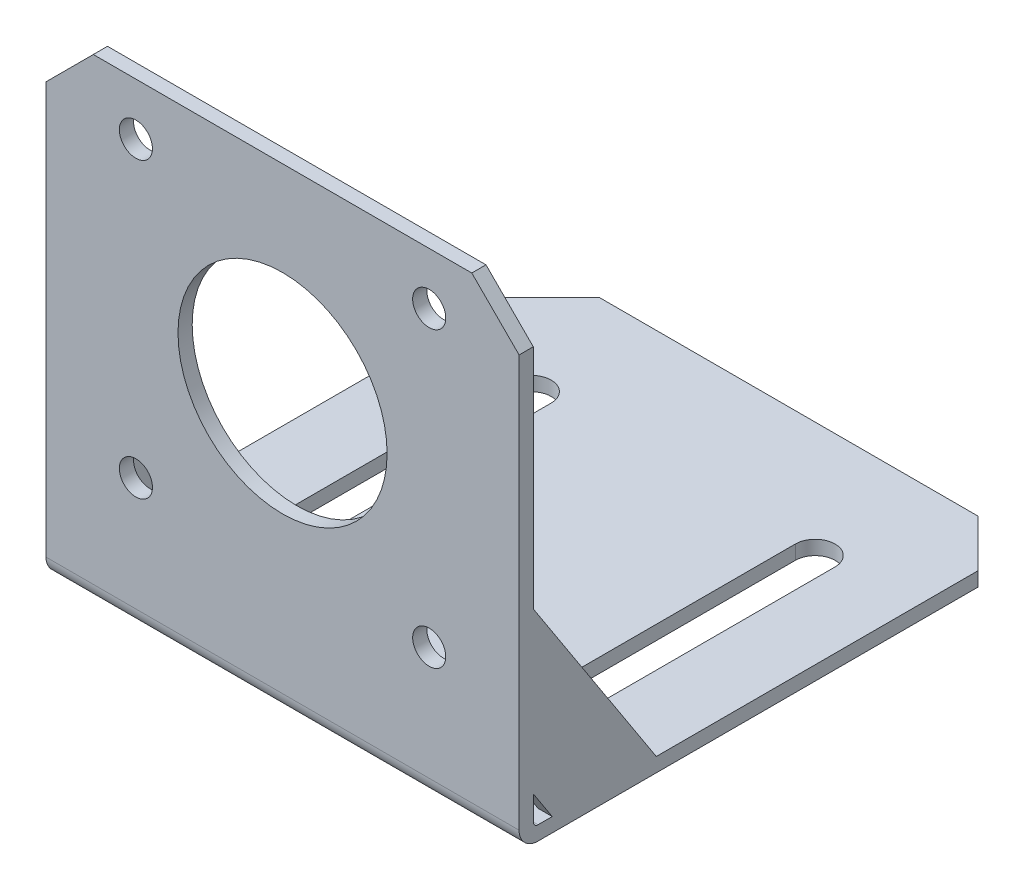
ISO-10303-21;
HEADER;
FILE_DESCRIPTION(('STEP AP214'),'2;1');
FILE_NAME('part.step','',(''),(''),'','','');
FILE_SCHEMA(('AUTOMOTIVE_DESIGN { 1 0 10303 214 1 1 1 1 }'));
ENDSEC;
DATA;
#1=APPLICATION_CONTEXT('core data for automotive mechanical design processes');
#2=APPLICATION_PROTOCOL_DEFINITION('international standard','automotive_design',2000,#1);
#3=PRODUCT_CONTEXT('',#1,'mechanical');
#4=PRODUCT('Part','Part','',(#3));
#5=PRODUCT_RELATED_PRODUCT_CATEGORY('part','',(#4));
#6=PRODUCT_DEFINITION_FORMATION('','',#4);
#7=PRODUCT_DEFINITION_CONTEXT('part definition',#1,'design');
#8=PRODUCT_DEFINITION('design','',#6,#7);
#9=PRODUCT_DEFINITION_SHAPE('','',#8);
#10=(LENGTH_UNIT() NAMED_UNIT(*) SI_UNIT(.MILLI.,.METRE.));
#11=(NAMED_UNIT(*) PLANE_ANGLE_UNIT() SI_UNIT($,.RADIAN.));
#12=(NAMED_UNIT(*) SI_UNIT($,.STERADIAN.) SOLID_ANGLE_UNIT());
#13=UNCERTAINTY_MEASURE_WITH_UNIT(LENGTH_MEASURE(1.E-05),#10,'distance_accuracy_value','');
#14=(GEOMETRIC_REPRESENTATION_CONTEXT(3) GLOBAL_UNCERTAINTY_ASSIGNED_CONTEXT((#13)) GLOBAL_UNIT_ASSIGNED_CONTEXT((#10,
#11,#12)) REPRESENTATION_CONTEXT('',''));
#15=CARTESIAN_POINT('',(0.,0.,0.));
#16=DIRECTION('',(0.,0.,1.));
#17=DIRECTION('',(1.,0.,0.));
#18=AXIS2_PLACEMENT_3D('',#15,#16,#17);
#19=CARTESIAN_POINT('',(50.,1.5,-2.00000000000001));
#20=DIRECTION('',(0.,1.,0.));
#21=DIRECTION('',(0.,0.,1.));
#22=AXIS2_PLACEMENT_3D('',#19,#20,#21);
#23=PLANE('',#22);
#24=CARTESIAN_POINT('',(40.,1.5,-13.7066664875901));
#25=DIRECTION('',(0.,1.,0.));
#26=DIRECTION('',(0.,0.,-1.));
#27=AXIS2_PLACEMENT_3D('',#24,#25,#26);
#28=CIRCLE('',#27,2.1);
#29=CARTESIAN_POINT('',(37.9,1.5,-13.7066664875901));
#30=VERTEX_POINT('',#29);
#31=CARTESIAN_POINT('',(42.1,1.5,-13.7066664875901));
#32=VERTEX_POINT('',#31);
#33=EDGE_CURVE('E225',#30,#32,#28,.T.);
#34=ORIENTED_EDGE('',*,*,#33,.F.);
#35=DIRECTION('',(0.,0.,1.));
#36=VECTOR('',#35,1.);
#37=CARTESIAN_POINT('',(37.9,1.5,-13.7066664875901));
#38=LINE('',#37,#36);
#39=CARTESIAN_POINT('',(37.9,1.5,-41.2933335124099));
#40=VERTEX_POINT('',#39);
#41=EDGE_CURVE('E243',#40,#30,#38,.T.);
#42=ORIENTED_EDGE('',*,*,#41,.F.);
#43=CARTESIAN_POINT('',(40.,1.5,-41.2933335124099));
#44=DIRECTION('',(0.,1.,0.));
#45=DIRECTION('',(0.,0.,-1.));
#46=AXIS2_PLACEMENT_3D('',#43,#44,#45);
#47=CIRCLE('',#46,2.09999999999998);
#48=CARTESIAN_POINT('',(42.1,1.5,-41.2933335124099));
#49=VERTEX_POINT('',#48);
#50=EDGE_CURVE('E246',#49,#40,#47,.T.);
#51=ORIENTED_EDGE('',*,*,#50,.F.);
#52=DIRECTION('',(0.,0.,-1.));
#53=VECTOR('',#52,1.);
#54=CARTESIAN_POINT('',(42.1,1.5,-13.7066664875901));
#55=LINE('',#54,#53);
#56=EDGE_CURVE('E252',#32,#49,#55,.T.);
#57=ORIENTED_EDGE('',*,*,#56,.F.);
#58=EDGE_LOOP('',(#34,#42,#51,#57));
#59=FACE_BOUND('',#58,.T.);
#60=CARTESIAN_POINT('',(10.,1.5,-13.7066664875901));
#61=DIRECTION('',(0.,1.,0.));
#62=DIRECTION('',(0.,0.,1.));
#63=AXIS2_PLACEMENT_3D('',#60,#61,#62);
#64=CIRCLE('',#63,2.10000000000001);
#65=CARTESIAN_POINT('',(7.9,1.5,-13.7066664875901));
#66=VERTEX_POINT('',#65);
#67=CARTESIAN_POINT('',(12.1,1.5,-13.7066664875901));
#68=VERTEX_POINT('',#67);
#69=EDGE_CURVE('E258',#66,#68,#64,.T.);
#70=ORIENTED_EDGE('',*,*,#69,.F.);
#71=DIRECTION('',(0.,0.,1.));
#72=VECTOR('',#71,1.);
#73=CARTESIAN_POINT('',(7.9,1.5,-13.7066664875901));
#74=LINE('',#73,#72);
#75=CARTESIAN_POINT('',(7.90000000000001,1.5,-41.2933335124099));
#76=VERTEX_POINT('',#75);
#77=EDGE_CURVE('E266',#76,#66,#74,.T.);
#78=ORIENTED_EDGE('',*,*,#77,.F.);
#79=CARTESIAN_POINT('',(10.,1.5,-41.2933335124099));
#80=DIRECTION('',(0.,1.,0.));
#81=DIRECTION('',(0.,0.,1.));
#82=AXIS2_PLACEMENT_3D('',#79,#80,#81);
#83=CIRCLE('',#82,2.09999999999999);
#84=CARTESIAN_POINT('',(12.1,1.5,-41.2933335124099));
#85=VERTEX_POINT('',#84);
#86=EDGE_CURVE('E280',#85,#76,#83,.T.);
#87=ORIENTED_EDGE('',*,*,#86,.F.);
#88=DIRECTION('',(0.,0.,-1.));
#89=VECTOR('',#88,1.);
#90=CARTESIAN_POINT('',(12.1,1.5,-13.7066664875901));
#91=LINE('',#90,#89);
#92=EDGE_CURVE('E277',#68,#85,#91,.T.);
#93=ORIENTED_EDGE('',*,*,#92,.F.);
#94=EDGE_LOOP('',(#70,#78,#87,#93));
#95=FACE_BOUND('',#94,.T.);
#96=DIRECTION('',(-1.,0.,0.));
#97=VECTOR('',#96,1.);
#98=CARTESIAN_POINT('',(50.,1.5,-53.5));
#99=LINE('',#98,#97);
#100=CARTESIAN_POINT('',(45.,1.5,-53.5));
#101=VERTEX_POINT('',#100);
#102=CARTESIAN_POINT('',(5.00000000000003,1.5,-53.5));
#103=VERTEX_POINT('',#102);
#104=EDGE_CURVE('E426',#101,#103,#99,.T.);
#105=ORIENTED_EDGE('',*,*,#104,.T.);
#106=DIRECTION('',(-0.707106781186549,0.,0.707106781186547));
#107=VECTOR('',#106,1.);
#108=CARTESIAN_POINT('',(1.75000000000008,1.5,-50.2500000000001));
#109=LINE('',#108,#107);
#110=CARTESIAN_POINT('',(0.,1.5,-48.5));
#111=VERTEX_POINT('',#110);
#112=EDGE_CURVE('E11',#103,#111,#109,.T.);
#113=ORIENTED_EDGE('',*,*,#112,.T.);
#114=DIRECTION('',(0.,0.,-1.));
#115=VECTOR('',#114,1.);
#116=CARTESIAN_POINT('',(0.,1.5,-2.00000000000001));
#117=LINE('',#116,#115);
#118=CARTESIAN_POINT('',(0.,1.5,-14.5));
#119=VERTEX_POINT('',#118);
#120=EDGE_CURVE('E397',#119,#111,#117,.T.);
#121=ORIENTED_EDGE('',*,*,#120,.F.);
#122=DIRECTION('',(-1.,0.,0.));
#123=VECTOR('',#122,1.);
#124=CARTESIAN_POINT('',(1.5,1.5,-14.5));
#125=LINE('',#124,#123);
#126=CARTESIAN_POINT('',(1.5,1.5,-14.5));
#127=VERTEX_POINT('',#126);
#128=EDGE_CURVE('E314',#127,#119,#125,.T.);
#129=ORIENTED_EDGE('',*,*,#128,.F.);
#130=DIRECTION('',(0.,0.,-1.));
#131=VECTOR('',#130,1.);
#132=CARTESIAN_POINT('',(1.5,1.5,-3.5));
#133=LINE('',#132,#131);
#134=CARTESIAN_POINT('',(1.5,1.5,-3.5));
#135=VERTEX_POINT('',#134);
#136=EDGE_CURVE('E300',#135,#127,#133,.T.);
#137=ORIENTED_EDGE('',*,*,#136,.F.);
#138=DIRECTION('',(-1.,0.,0.));
#139=VECTOR('',#138,1.);
#140=CARTESIAN_POINT('',(1.5,1.5,-3.5));
#141=LINE('',#140,#139);
#142=CARTESIAN_POINT('',(0.,1.5,-3.5));
#143=VERTEX_POINT('',#142);
#144=EDGE_CURVE('E311',#135,#143,#141,.T.);
#145=ORIENTED_EDGE('',*,*,#144,.T.);
#146=CARTESIAN_POINT('',(0.,1.5,-2.00000000000001));
#147=VERTEX_POINT('',#146);
#148=EDGE_CURVE('E398',#147,#143,#117,.T.);
#149=ORIENTED_EDGE('',*,*,#148,.F.);
#150=DIRECTION('',(-1.,0.,0.));
#151=VECTOR('',#150,1.);
#152=CARTESIAN_POINT('',(50.,1.5,-2.00000000000001));
#153=LINE('',#152,#151);
#154=CARTESIAN_POINT('',(50.,1.5,-2.00000000000001));
#155=VERTEX_POINT('',#154);
#156=EDGE_CURVE('E424',#155,#147,#153,.T.);
#157=ORIENTED_EDGE('',*,*,#156,.F.);
#158=DIRECTION('',(0.,0.,-1.));
#159=VECTOR('',#158,1.);
#160=CARTESIAN_POINT('',(50.,1.5,-2.00000000000001));
#161=LINE('',#160,#159);
#162=CARTESIAN_POINT('',(50.,1.5,-3.5));
#163=VERTEX_POINT('',#162);
#164=EDGE_CURVE('E382',#155,#163,#161,.T.);
#165=ORIENTED_EDGE('',*,*,#164,.T.);
#166=DIRECTION('',(1.,0.,0.));
#167=VECTOR('',#166,1.);
#168=CARTESIAN_POINT('',(48.5,1.5,-3.5));
#169=LINE('',#168,#167);
#170=CARTESIAN_POINT('',(48.5,1.5,-3.5));
#171=VERTEX_POINT('',#170);
#172=EDGE_CURVE('E342',#171,#163,#169,.T.);
#173=ORIENTED_EDGE('',*,*,#172,.F.);
#174=DIRECTION('',(0.,0.,-1.));
#175=VECTOR('',#174,1.);
#176=CARTESIAN_POINT('',(48.5,1.5,-3.5));
#177=LINE('',#176,#175);
#178=CARTESIAN_POINT('',(48.5,1.5,-14.5));
#179=VERTEX_POINT('',#178);
#180=EDGE_CURVE('E325',#171,#179,#177,.T.);
#181=ORIENTED_EDGE('',*,*,#180,.T.);
#182=DIRECTION('',(1.,0.,0.));
#183=VECTOR('',#182,1.);
#184=CARTESIAN_POINT('',(48.5,1.5,-14.5));
#185=LINE('',#184,#183);
#186=CARTESIAN_POINT('',(50.,1.5,-14.5));
#187=VERTEX_POINT('',#186);
#188=EDGE_CURVE('E339',#179,#187,#185,.T.);
#189=ORIENTED_EDGE('',*,*,#188,.T.);
#190=CARTESIAN_POINT('',(50.,1.5,-48.5));
#191=VERTEX_POINT('',#190);
#192=EDGE_CURVE('E380',#187,#191,#161,.T.);
#193=ORIENTED_EDGE('',*,*,#192,.T.);
#194=DIRECTION('',(0.707106781186547,0.,0.707106781186549));
#195=VECTOR('',#194,1.);
#196=CARTESIAN_POINT('',(73.25,1.5,-25.2499999999999));
#197=LINE('',#196,#195);
#198=EDGE_CURVE('E41',#191,#101,#197,.F.);
#199=ORIENTED_EDGE('',*,*,#198,.T.);
#200=EDGE_LOOP('',(#105,#113,#121,#129,#137,#145,#149,#157,#165,#173,#181,#189,#193,#199));
#201=FACE_BOUND('',#200,.T.);
#202=ADVANCED_FACE('F33',(#59,#95,#201),#23,.T.);
#203=CARTESIAN_POINT('',(50.,2.00000000000001,-1.5));
#204=DIRECTION('',(0.,0.,-1.));
#205=DIRECTION('',(-1.,0.,0.));
#206=AXIS2_PLACEMENT_3D('',#203,#204,#205);
#207=PLANE('',#206);
#208=CARTESIAN_POINT('',(25.,29.5,-1.5));
#209=DIRECTION('',(0.,0.,-1.));
#210=DIRECTION('',(-1.,0.,0.));
#211=AXIS2_PLACEMENT_3D('',#208,#209,#210);
#212=CIRCLE('',#211,11.05);
#213=CARTESIAN_POINT('',(13.95,29.5,-1.5));
#214=VERTEX_POINT('',#213);
#215=EDGE_CURVE('E368',#214,#214,#212,.T.);
#216=ORIENTED_EDGE('',*,*,#215,.F.);
#217=EDGE_LOOP('',(#216));
#218=FACE_BOUND('',#217,.T.);
#219=CARTESIAN_POINT('',(40.5,45.,-1.5));
#220=DIRECTION('',(0.,0.,-1.));
#221=DIRECTION('',(-1.,0.,0.));
#222=AXIS2_PLACEMENT_3D('',#219,#220,#221);
#223=CIRCLE('',#222,1.75);
#224=CARTESIAN_POINT('',(38.75,45.,-1.5));
#225=VERTEX_POINT('',#224);
#226=EDGE_CURVE('E362',#225,#225,#223,.T.);
#227=ORIENTED_EDGE('',*,*,#226,.F.);
#228=EDGE_LOOP('',(#227));
#229=FACE_BOUND('',#228,.T.);
#230=CARTESIAN_POINT('',(9.49999999999999,45.,-1.5));
#231=DIRECTION('',(0.,0.,-1.));
#232=DIRECTION('',(-1.,0.,0.));
#233=AXIS2_PLACEMENT_3D('',#230,#231,#232);
#234=CIRCLE('',#233,1.75);
#235=CARTESIAN_POINT('',(7.74999999999999,45.,-1.5));
#236=VERTEX_POINT('',#235);
#237=EDGE_CURVE('E356',#236,#236,#234,.T.);
#238=ORIENTED_EDGE('',*,*,#237,.F.);
#239=EDGE_LOOP('',(#238));
#240=FACE_BOUND('',#239,.T.);
#241=CARTESIAN_POINT('',(9.5,14.,-1.5));
#242=DIRECTION('',(0.,0.,-1.));
#243=DIRECTION('',(-1.,0.,0.));
#244=AXIS2_PLACEMENT_3D('',#241,#242,#243);
#245=CIRCLE('',#244,1.75000000000001);
#246=CARTESIAN_POINT('',(7.74999999999999,14.,-1.5));
#247=VERTEX_POINT('',#246);
#248=EDGE_CURVE('E350',#247,#247,#245,.T.);
#249=ORIENTED_EDGE('',*,*,#248,.F.);
#250=EDGE_LOOP('',(#249));
#251=FACE_BOUND('',#250,.T.);
#252=CARTESIAN_POINT('',(40.5,14.,-1.5));
#253=DIRECTION('',(0.,0.,-1.));
#254=DIRECTION('',(-1.,0.,0.));
#255=AXIS2_PLACEMENT_3D('',#252,#253,#254);
#256=CIRCLE('',#255,1.75000000000001);
#257=CARTESIAN_POINT('',(38.75,14.,-1.5));
#258=VERTEX_POINT('',#257);
#259=EDGE_CURVE('E338',#258,#258,#256,.T.);
#260=ORIENTED_EDGE('',*,*,#259,.F.);
#261=EDGE_LOOP('',(#260));
#262=FACE_BOUND('',#261,.T.);
#263=DIRECTION('',(-1.,0.,0.));
#264=VECTOR('',#263,1.);
#265=CARTESIAN_POINT('',(50.,50.5,-1.5));
#266=LINE('',#265,#264);
#267=CARTESIAN_POINT('',(45.,50.5,-1.5));
#268=VERTEX_POINT('',#267);
#269=CARTESIAN_POINT('',(5.00000000000003,50.5,-1.5));
#270=VERTEX_POINT('',#269);
#271=EDGE_CURVE('E418',#268,#270,#266,.T.);
#272=ORIENTED_EDGE('',*,*,#271,.F.);
#273=DIRECTION('',(-0.707106781186547,0.707106781186549,0.));
#274=VECTOR('',#273,1.);
#275=CARTESIAN_POINT('',(71.75,23.7499999999999,-1.5));
#276=LINE('',#275,#274);
#277=CARTESIAN_POINT('',(50.,45.5,-1.5));
#278=VERTEX_POINT('',#277);
#279=EDGE_CURVE('E437',#268,#278,#276,.F.);
#280=ORIENTED_EDGE('',*,*,#279,.T.);
#281=DIRECTION('',(0.,1.,0.));
#282=VECTOR('',#281,1.);
#283=CARTESIAN_POINT('',(50.,2.00000000000001,-1.5));
#284=LINE('',#283,#282);
#285=CARTESIAN_POINT('',(50.,21.5,-1.5));
#286=VERTEX_POINT('',#285);
#287=EDGE_CURVE('E388',#278,#286,#284,.F.);
#288=ORIENTED_EDGE('',*,*,#287,.T.);
#289=DIRECTION('',(1.,0.,0.));
#290=VECTOR('',#289,1.);
#291=CARTESIAN_POINT('',(48.5,21.5,-1.5));
#292=LINE('',#291,#290);
#293=CARTESIAN_POINT('',(48.5,21.5,-1.5));
#294=VERTEX_POINT('',#293);
#295=EDGE_CURVE('E335',#294,#286,#292,.T.);
#296=ORIENTED_EDGE('',*,*,#295,.F.);
#297=DIRECTION('',(0.,-1.,0.));
#298=VECTOR('',#297,1.);
#299=CARTESIAN_POINT('',(48.5,21.5,-1.5));
#300=LINE('',#299,#298);
#301=CARTESIAN_POINT('',(48.5,4.57692307692308,-1.5));
#302=VERTEX_POINT('',#301);
#303=EDGE_CURVE('E319',#294,#302,#300,.T.);
#304=ORIENTED_EDGE('',*,*,#303,.T.);
#305=DIRECTION('',(1.,0.,0.));
#306=VECTOR('',#305,1.);
#307=CARTESIAN_POINT('',(48.5,4.57692307692308,-1.5));
#308=LINE('',#307,#306);
#309=CARTESIAN_POINT('',(50.,4.57692307692308,-1.5));
#310=VERTEX_POINT('',#309);
#311=EDGE_CURVE('E330',#302,#310,#308,.T.);
#312=ORIENTED_EDGE('',*,*,#311,.T.);
#313=CARTESIAN_POINT('',(50.,2.,-1.5));
#314=VERTEX_POINT('',#313);
#315=EDGE_CURVE('E387',#310,#314,#284,.F.);
#316=ORIENTED_EDGE('',*,*,#315,.T.);
#317=DIRECTION('',(-1.,0.,0.));
#318=VECTOR('',#317,1.);
#319=CARTESIAN_POINT('',(50.,2.,-1.5));
#320=LINE('',#319,#318);
#321=CARTESIAN_POINT('',(0.,2.,-1.5));
#322=VERTEX_POINT('',#321);
#323=EDGE_CURVE('E421',#314,#322,#320,.T.);
#324=ORIENTED_EDGE('',*,*,#323,.T.);
#325=DIRECTION('',(0.,1.,0.));
#326=VECTOR('',#325,1.);
#327=CARTESIAN_POINT('',(0.,2.00000000000001,-1.5));
#328=LINE('',#327,#326);
#329=CARTESIAN_POINT('',(0.,4.57692307692308,-1.5));
#330=VERTEX_POINT('',#329);
#331=EDGE_CURVE('E404',#330,#322,#328,.F.);
#332=ORIENTED_EDGE('',*,*,#331,.F.);
#333=DIRECTION('',(-1.,0.,0.));
#334=VECTOR('',#333,1.);
#335=CARTESIAN_POINT('',(1.5,4.57692307692308,-1.5));
#336=LINE('',#335,#334);
#337=CARTESIAN_POINT('',(1.5,4.57692307692308,-1.5));
#338=VERTEX_POINT('',#337);
#339=EDGE_CURVE('E308',#338,#330,#336,.T.);
#340=ORIENTED_EDGE('',*,*,#339,.F.);
#341=DIRECTION('',(0.,-1.,0.));
#342=VECTOR('',#341,1.);
#343=CARTESIAN_POINT('',(1.5,21.5,-1.5));
#344=LINE('',#343,#342);
#345=CARTESIAN_POINT('',(1.5,21.5,-1.5));
#346=VERTEX_POINT('',#345);
#347=EDGE_CURVE('E294',#346,#338,#344,.T.);
#348=ORIENTED_EDGE('',*,*,#347,.F.);
#349=DIRECTION('',(-1.,0.,0.));
#350=VECTOR('',#349,1.);
#351=CARTESIAN_POINT('',(1.5,21.5,-1.5));
#352=LINE('',#351,#350);
#353=CARTESIAN_POINT('',(0.,21.5,-1.5));
#354=VERTEX_POINT('',#353);
#355=EDGE_CURVE('E304',#346,#354,#352,.T.);
#356=ORIENTED_EDGE('',*,*,#355,.T.);
#357=CARTESIAN_POINT('',(0.,45.5,-1.5));
#358=VERTEX_POINT('',#357);
#359=EDGE_CURVE('E405',#358,#354,#328,.F.);
#360=ORIENTED_EDGE('',*,*,#359,.F.);
#361=DIRECTION('',(0.707106781186549,0.707106781186547,0.));
#362=VECTOR('',#361,1.);
#363=CARTESIAN_POINT('',(3.25000000000009,48.7500000000001,-1.5));
#364=LINE('',#363,#362);
#365=EDGE_CURVE('E435',#358,#270,#364,.T.);
#366=ORIENTED_EDGE('',*,*,#365,.T.);
#367=EDGE_LOOP('',(#272,#280,#288,#296,#304,#312,#316,#324,#332,#340,#348,#356,#360,#366));
#368=FACE_BOUND('',#367,.T.);
#369=ADVANCED_FACE('F533',(#218,#229,#240,#251,#262,#368),#207,.T.);
#370=CARTESIAN_POINT('',(50.,0.,-2.00000000000001));
#371=DIRECTION('',(0.,1.,0.));
#372=DIRECTION('',(0.,0.,1.));
#373=AXIS2_PLACEMENT_3D('',#370,#371,#372);
#374=PLANE('',#373);
#375=DIRECTION('',(0.,0.,1.));
#376=VECTOR('',#375,1.);
#377=CARTESIAN_POINT('',(37.9,0.,-13.7066664875901));
#378=LINE('',#377,#376);
#379=CARTESIAN_POINT('',(37.9,0.,-41.2933335124099));
#380=VERTEX_POINT('',#379);
#381=CARTESIAN_POINT('',(37.9,0.,-13.7066664875901));
#382=VERTEX_POINT('',#381);
#383=EDGE_CURVE('E230',#380,#382,#378,.T.);
#384=ORIENTED_EDGE('',*,*,#383,.T.);
#385=CARTESIAN_POINT('',(40.,0.,-13.7066664875901));
#386=DIRECTION('',(0.,1.,0.));
#387=DIRECTION('',(0.,0.,-1.));
#388=AXIS2_PLACEMENT_3D('',#385,#386,#387);
#389=CIRCLE('',#388,2.1);
#390=CARTESIAN_POINT('',(42.1,0.,-13.7066664875901));
#391=VERTEX_POINT('',#390);
#392=EDGE_CURVE('E222',#382,#391,#389,.T.);
#393=ORIENTED_EDGE('',*,*,#392,.T.);
#394=DIRECTION('',(0.,0.,-1.));
#395=VECTOR('',#394,1.);
#396=CARTESIAN_POINT('',(42.1,0.,-13.7066664875901));
#397=LINE('',#396,#395);
#398=CARTESIAN_POINT('',(42.1,0.,-41.2933335124099));
#399=VERTEX_POINT('',#398);
#400=EDGE_CURVE('E234',#391,#399,#397,.T.);
#401=ORIENTED_EDGE('',*,*,#400,.T.);
#402=CARTESIAN_POINT('',(40.,0.,-41.2933335124099));
#403=DIRECTION('',(0.,1.,0.));
#404=DIRECTION('',(0.,0.,-1.));
#405=AXIS2_PLACEMENT_3D('',#402,#403,#404);
#406=CIRCLE('',#405,2.09999999999998);
#407=EDGE_CURVE('E238',#399,#380,#406,.T.);
#408=ORIENTED_EDGE('',*,*,#407,.T.);
#409=EDGE_LOOP('',(#384,#393,#401,#408));
#410=FACE_BOUND('',#409,.T.);
#411=DIRECTION('',(0.,0.,1.));
#412=VECTOR('',#411,1.);
#413=CARTESIAN_POINT('',(7.9,0.,-13.7066664875901));
#414=LINE('',#413,#412);
#415=CARTESIAN_POINT('',(7.90000000000001,0.,-41.2933335124099));
#416=VERTEX_POINT('',#415);
#417=CARTESIAN_POINT('',(7.9,0.,-13.7066664875901));
#418=VERTEX_POINT('',#417);
#419=EDGE_CURVE('E272',#416,#418,#414,.T.);
#420=ORIENTED_EDGE('',*,*,#419,.T.);
#421=CARTESIAN_POINT('',(10.,0.,-13.7066664875901));
#422=DIRECTION('',(0.,1.,0.));
#423=DIRECTION('',(0.,0.,1.));
#424=AXIS2_PLACEMENT_3D('',#421,#422,#423);
#425=CIRCLE('',#424,2.10000000000001);
#426=CARTESIAN_POINT('',(12.1,0.,-13.7066664875901));
#427=VERTEX_POINT('',#426);
#428=EDGE_CURVE('E262',#418,#427,#425,.T.);
#429=ORIENTED_EDGE('',*,*,#428,.T.);
#430=DIRECTION('',(0.,0.,-1.));
#431=VECTOR('',#430,1.);
#432=CARTESIAN_POINT('',(12.1,0.,-13.7066664875901));
#433=LINE('',#432,#431);
#434=CARTESIAN_POINT('',(12.1,0.,-41.2933335124099));
#435=VERTEX_POINT('',#434);
#436=EDGE_CURVE('E265',#427,#435,#433,.T.);
#437=ORIENTED_EDGE('',*,*,#436,.T.);
#438=CARTESIAN_POINT('',(10.,0.,-41.2933335124099));
#439=DIRECTION('',(0.,1.,0.));
#440=DIRECTION('',(0.,0.,1.));
#441=AXIS2_PLACEMENT_3D('',#438,#439,#440);
#442=CIRCLE('',#441,2.09999999999999);
#443=EDGE_CURVE('E269',#435,#416,#442,.T.);
#444=ORIENTED_EDGE('',*,*,#443,.T.);
#445=EDGE_LOOP('',(#420,#429,#437,#444));
#446=FACE_BOUND('',#445,.T.);
#447=DIRECTION('',(0.,0.,-1.));
#448=VECTOR('',#447,1.);
#449=CARTESIAN_POINT('',(0.,0.,-2.00000000000001));
#450=LINE('',#449,#448);
#451=CARTESIAN_POINT('',(0.,0.,-2.00000000000001));
#452=VERTEX_POINT('',#451);
#453=CARTESIAN_POINT('',(0.,0.,-48.5));
#454=VERTEX_POINT('',#453);
#455=EDGE_CURVE('E374',#452,#454,#450,.T.);
#456=ORIENTED_EDGE('',*,*,#455,.T.);
#457=DIRECTION('',(0.707106781186549,0.,-0.707106781186547));
#458=VECTOR('',#457,1.);
#459=CARTESIAN_POINT('',(0.,0.,-48.5));
#460=LINE('',#459,#458);
#461=CARTESIAN_POINT('',(5.00000000000002,0.,-53.5));
#462=VERTEX_POINT('',#461);
#463=EDGE_CURVE('E455',#454,#462,#460,.T.);
#464=ORIENTED_EDGE('',*,*,#463,.T.);
#465=DIRECTION('',(-1.,0.,0.));
#466=VECTOR('',#465,1.);
#467=CARTESIAN_POINT('',(50.,0.,-53.5));
#468=LINE('',#467,#466);
#469=CARTESIAN_POINT('',(45.,0.,-53.5));
#470=VERTEX_POINT('',#469);
#471=EDGE_CURVE('E428',#470,#462,#468,.T.);
#472=ORIENTED_EDGE('',*,*,#471,.F.);
#473=DIRECTION('',(-0.707106781186547,0.,-0.707106781186549));
#474=VECTOR('',#473,1.);
#475=CARTESIAN_POINT('',(45.,0.,-53.5));
#476=LINE('',#475,#474);
#477=CARTESIAN_POINT('',(50.,0.,-48.5));
#478=VERTEX_POINT('',#477);
#479=EDGE_CURVE('E453',#470,#478,#476,.F.);
#480=ORIENTED_EDGE('',*,*,#479,.T.);
#481=DIRECTION('',(0.,0.,-1.));
#482=VECTOR('',#481,1.);
#483=CARTESIAN_POINT('',(50.,0.,-2.00000000000001));
#484=LINE('',#483,#482);
#485=CARTESIAN_POINT('',(50.,0.,-2.00000000000001));
#486=VERTEX_POINT('',#485);
#487=EDGE_CURVE('E377',#486,#478,#484,.T.);
#488=ORIENTED_EDGE('',*,*,#487,.F.);
#489=DIRECTION('',(-1.,0.,0.));
#490=VECTOR('',#489,1.);
#491=CARTESIAN_POINT('',(50.,0.,-2.00000000000001));
#492=LINE('',#491,#490);
#493=EDGE_CURVE('E394',#486,#452,#492,.T.);
#494=ORIENTED_EDGE('',*,*,#493,.T.);
#495=EDGE_LOOP('',(#456,#464,#472,#480,#488,#494));
#496=FACE_BOUND('',#495,.T.);
#497=ADVANCED_FACE('F240',(#410,#446,#496),#374,.F.);
#498=CARTESIAN_POINT('',(50.,1.5,-53.5));
#499=DIRECTION('',(0.,0.,-1.));
#500=DIRECTION('',(-1.,0.,0.));
#501=AXIS2_PLACEMENT_3D('',#498,#499,#500);
#502=PLANE('',#501);
#503=ORIENTED_EDGE('',*,*,#471,.T.);
#504=DIRECTION('',(0.,1.,0.));
#505=VECTOR('',#504,1.);
#506=CARTESIAN_POINT('',(5.00000000000002,1.5,-53.5));
#507=LINE('',#506,#505);
#508=EDGE_CURVE('E48',#462,#103,#507,.T.);
#509=ORIENTED_EDGE('',*,*,#508,.T.);
#510=ORIENTED_EDGE('',*,*,#104,.F.);
#511=DIRECTION('',(0.,-1.,0.));
#512=VECTOR('',#511,1.);
#513=CARTESIAN_POINT('',(45.,1.5,-53.5));
#514=LINE('',#513,#512);
#515=EDGE_CURVE('E457',#101,#470,#514,.T.);
#516=ORIENTED_EDGE('',*,*,#515,.T.);
#517=EDGE_LOOP('',(#503,#509,#510,#516));
#518=FACE_BOUND('',#517,.T.);
#519=ADVANCED_FACE('F462',(#518),#502,.T.);
#520=CARTESIAN_POINT('',(50.,2.,-2.));
#521=DIRECTION('',(-1.,0.,0.));
#522=DIRECTION('',(0.,0.,1.));
#523=AXIS2_PLACEMENT_3D('',#520,#521,#522);
#524=CYLINDRICAL_SURFACE('',#523,0.5);
#525=CARTESIAN_POINT('',(0.,2.,-2.));
#526=DIRECTION('',(1.,0.,0.));
#527=DIRECTION('',(0.,0.,-1.));
#528=AXIS2_PLACEMENT_3D('',#525,#526,#527);
#529=CIRCLE('',#528,0.5);
#530=EDGE_CURVE('E401',#322,#147,#529,.T.);
#531=ORIENTED_EDGE('',*,*,#530,.F.);
#532=ORIENTED_EDGE('',*,*,#323,.F.);
#533=CARTESIAN_POINT('',(50.,2.,-2.));
#534=DIRECTION('',(1.,0.,0.));
#535=DIRECTION('',(0.,0.,-1.));
#536=AXIS2_PLACEMENT_3D('',#533,#534,#535);
#537=CIRCLE('',#536,0.5);
#538=EDGE_CURVE('E384',#314,#155,#537,.T.);
#539=ORIENTED_EDGE('',*,*,#538,.T.);
#540=ORIENTED_EDGE('',*,*,#156,.T.);
#541=EDGE_LOOP('',(#531,#532,#539,#540));
#542=FACE_BOUND('',#541,.T.);
#543=ADVANCED_FACE('F497',(#542),#524,.F.);
#544=CARTESIAN_POINT('',(50.,50.5,0.));
#545=DIRECTION('',(0.,1.,0.));
#546=DIRECTION('',(0.,0.,1.));
#547=AXIS2_PLACEMENT_3D('',#544,#545,#546);
#548=PLANE('',#547);
#549=DIRECTION('',(-1.,0.,0.));
#550=VECTOR('',#549,1.);
#551=CARTESIAN_POINT('',(50.,50.5,0.));
#552=LINE('',#551,#550);
#553=CARTESIAN_POINT('',(45.,50.5,0.));
#554=VERTEX_POINT('',#553);
#555=CARTESIAN_POINT('',(5.00000000000005,50.5,0.));
#556=VERTEX_POINT('',#555);
#557=EDGE_CURVE('E415',#554,#556,#552,.T.);
#558=ORIENTED_EDGE('',*,*,#557,.F.);
#559=DIRECTION('',(0.,0.,-1.));
#560=VECTOR('',#559,1.);
#561=CARTESIAN_POINT('',(45.,50.5,0.));
#562=LINE('',#561,#560);
#563=EDGE_CURVE('E432',#554,#268,#562,.T.);
#564=ORIENTED_EDGE('',*,*,#563,.T.);
#565=ORIENTED_EDGE('',*,*,#271,.T.);
#566=DIRECTION('',(0.,0.,1.));
#567=VECTOR('',#566,1.);
#568=CARTESIAN_POINT('',(5.00000000000003,50.5,0.));
#569=LINE('',#568,#567);
#570=EDGE_CURVE('E430',#270,#556,#569,.T.);
#571=ORIENTED_EDGE('',*,*,#570,.T.);
#572=EDGE_LOOP('',(#558,#564,#565,#571));
#573=FACE_BOUND('',#572,.T.);
#574=ADVANCED_FACE('F536',(#573),#548,.T.);
#575=CARTESIAN_POINT('',(50.,2.00000000000001,0.));
#576=DIRECTION('',(0.,0.,-1.));
#577=DIRECTION('',(-1.,0.,0.));
#578=AXIS2_PLACEMENT_3D('',#575,#576,#577);
#579=PLANE('',#578);
#580=CARTESIAN_POINT('',(40.5,14.,0.));
#581=DIRECTION('',(0.,0.,-1.));
#582=DIRECTION('',(-1.,0.,0.));
#583=AXIS2_PLACEMENT_3D('',#580,#581,#582);
#584=CIRCLE('',#583,1.75000000000001);
#585=CARTESIAN_POINT('',(38.75,14.,0.));
#586=VERTEX_POINT('',#585);
#587=EDGE_CURVE('E347',#586,#586,#584,.T.);
#588=ORIENTED_EDGE('',*,*,#587,.T.);
#589=EDGE_LOOP('',(#588));
#590=FACE_BOUND('',#589,.T.);
#591=CARTESIAN_POINT('',(9.5,14.,0.));
#592=DIRECTION('',(0.,0.,-1.));
#593=DIRECTION('',(-1.,0.,0.));
#594=AXIS2_PLACEMENT_3D('',#591,#592,#593);
#595=CIRCLE('',#594,1.75000000000001);
#596=CARTESIAN_POINT('',(7.74999999999999,14.,0.));
#597=VERTEX_POINT('',#596);
#598=EDGE_CURVE('E353',#597,#597,#595,.T.);
#599=ORIENTED_EDGE('',*,*,#598,.T.);
#600=EDGE_LOOP('',(#599));
#601=FACE_BOUND('',#600,.T.);
#602=CARTESIAN_POINT('',(9.49999999999999,45.,0.));
#603=DIRECTION('',(0.,0.,-1.));
#604=DIRECTION('',(-1.,0.,0.));
#605=AXIS2_PLACEMENT_3D('',#602,#603,#604);
#606=CIRCLE('',#605,1.75);
#607=CARTESIAN_POINT('',(7.74999999999999,45.,0.));
#608=VERTEX_POINT('',#607);
#609=EDGE_CURVE('E359',#608,#608,#606,.T.);
#610=ORIENTED_EDGE('',*,*,#609,.T.);
#611=EDGE_LOOP('',(#610));
#612=FACE_BOUND('',#611,.T.);
#613=CARTESIAN_POINT('',(40.5,45.,0.));
#614=DIRECTION('',(0.,0.,-1.));
#615=DIRECTION('',(-1.,0.,0.));
#616=AXIS2_PLACEMENT_3D('',#613,#614,#615);
#617=CIRCLE('',#616,1.75);
#618=CARTESIAN_POINT('',(38.75,45.,0.));
#619=VERTEX_POINT('',#618);
#620=EDGE_CURVE('E365',#619,#619,#617,.T.);
#621=ORIENTED_EDGE('',*,*,#620,.T.);
#622=EDGE_LOOP('',(#621));
#623=FACE_BOUND('',#622,.T.);
#624=CARTESIAN_POINT('',(25.,29.5,0.));
#625=DIRECTION('',(0.,0.,-1.));
#626=DIRECTION('',(-1.,0.,0.));
#627=AXIS2_PLACEMENT_3D('',#624,#625,#626);
#628=CIRCLE('',#627,11.05);
#629=CARTESIAN_POINT('',(13.95,29.5,0.));
#630=VERTEX_POINT('',#629);
#631=EDGE_CURVE('E371',#630,#630,#628,.T.);
#632=ORIENTED_EDGE('',*,*,#631,.T.);
#633=EDGE_LOOP('',(#632));
#634=FACE_BOUND('',#633,.T.);
#635=DIRECTION('',(0.,-1.,0.));
#636=VECTOR('',#635,1.);
#637=CARTESIAN_POINT('',(50.,2.00000000000001,0.));
#638=LINE('',#637,#636);
#639=CARTESIAN_POINT('',(50.,45.5,0.));
#640=VERTEX_POINT('',#639);
#641=CARTESIAN_POINT('',(50.,2.00000000000001,0.));
#642=VERTEX_POINT('',#641);
#643=EDGE_CURVE('E390',#640,#642,#638,.T.);
#644=ORIENTED_EDGE('',*,*,#643,.F.);
#645=DIRECTION('',(0.707106781186547,-0.707106781186549,0.));
#646=VECTOR('',#645,1.);
#647=CARTESIAN_POINT('',(45.,50.5,0.));
#648=LINE('',#647,#646);
#649=EDGE_CURVE('E445',#640,#554,#648,.F.);
#650=ORIENTED_EDGE('',*,*,#649,.T.);
#651=ORIENTED_EDGE('',*,*,#557,.T.);
#652=DIRECTION('',(-0.707106781186549,-0.707106781186547,0.));
#653=VECTOR('',#652,1.);
#654=CARTESIAN_POINT('',(0.,45.5,0.));
#655=LINE('',#654,#653);
#656=CARTESIAN_POINT('',(0.,45.5,0.));
#657=VERTEX_POINT('',#656);
#658=EDGE_CURVE('E443',#556,#657,#655,.T.);
#659=ORIENTED_EDGE('',*,*,#658,.T.);
#660=DIRECTION('',(0.,-1.,0.));
#661=VECTOR('',#660,1.);
#662=CARTESIAN_POINT('',(0.,2.00000000000001,0.));
#663=LINE('',#662,#661);
#664=CARTESIAN_POINT('',(0.,2.00000000000001,0.));
#665=VERTEX_POINT('',#664);
#666=EDGE_CURVE('E407',#657,#665,#663,.T.);
#667=ORIENTED_EDGE('',*,*,#666,.T.);
#668=DIRECTION('',(-1.,0.,0.));
#669=VECTOR('',#668,1.);
#670=CARTESIAN_POINT('',(50.,2.00000000000001,0.));
#671=LINE('',#670,#669);
#672=EDGE_CURVE('E412',#642,#665,#671,.T.);
#673=ORIENTED_EDGE('',*,*,#672,.F.);
#674=EDGE_LOOP('',(#644,#650,#651,#659,#667,#673));
#675=FACE_BOUND('',#674,.T.);
#676=ADVANCED_FACE('F543',(#590,#601,#612,#623,#634,#675),#579,.F.);
#677=CARTESIAN_POINT('',(50.,2.,-2.));
#678=DIRECTION('',(-1.,0.,0.));
#679=DIRECTION('',(0.,0.,1.));
#680=AXIS2_PLACEMENT_3D('',#677,#678,#679);
#681=CYLINDRICAL_SURFACE('',#680,2.);
#682=CARTESIAN_POINT('',(0.,2.,-2.));
#683=DIRECTION('',(1.,0.,0.));
#684=DIRECTION('',(0.,0.,-1.));
#685=AXIS2_PLACEMENT_3D('',#682,#683,#684);
#686=CIRCLE('',#685,2.);
#687=EDGE_CURVE('E381',#665,#452,#686,.T.);
#688=ORIENTED_EDGE('',*,*,#687,.T.);
#689=ORIENTED_EDGE('',*,*,#493,.F.);
#690=CARTESIAN_POINT('',(50.,2.,-2.));
#691=DIRECTION('',(1.,0.,0.));
#692=DIRECTION('',(0.,0.,-1.));
#693=AXIS2_PLACEMENT_3D('',#690,#691,#692);
#694=CIRCLE('',#693,2.);
#695=EDGE_CURVE('E392',#642,#486,#694,.T.);
#696=ORIENTED_EDGE('',*,*,#695,.F.);
#697=ORIENTED_EDGE('',*,*,#672,.T.);
#698=EDGE_LOOP('',(#688,#689,#696,#697));
#699=FACE_BOUND('',#698,.T.);
#700=ADVANCED_FACE('F522',(#699),#681,.T.);
#701=CARTESIAN_POINT('',(50.,2.,-2.));
#702=DIRECTION('',(1.,0.,0.));
#703=DIRECTION('',(0.,0.,-1.));
#704=AXIS2_PLACEMENT_3D('',#701,#702,#703);
#705=PLANE('',#704);
#706=ORIENTED_EDGE('',*,*,#315,.F.);
#707=DIRECTION('',(0.,-0.838443616300637,-0.544988350595414));
#708=VECTOR('',#707,1.);
#709=CARTESIAN_POINT('',(50.,4.57692307692308,-1.5));
#710=LINE('',#709,#708);
#711=EDGE_CURVE('E310',#310,#163,#710,.T.);
#712=ORIENTED_EDGE('',*,*,#711,.T.);
#713=ORIENTED_EDGE('',*,*,#164,.F.);
#714=ORIENTED_EDGE('',*,*,#538,.F.);
#715=EDGE_LOOP('',(#706,#712,#713,#714));
#716=FACE_BOUND('',#715,.T.);
#717=ORIENTED_EDGE('',*,*,#287,.F.);
#718=DIRECTION('',(0.,0.,1.));
#719=VECTOR('',#718,1.);
#720=CARTESIAN_POINT('',(50.,45.5,-2.));
#721=LINE('',#720,#719);
#722=EDGE_CURVE('E441',#278,#640,#721,.T.);
#723=ORIENTED_EDGE('',*,*,#722,.T.);
#724=ORIENTED_EDGE('',*,*,#643,.T.);
#725=ORIENTED_EDGE('',*,*,#695,.T.);
#726=ORIENTED_EDGE('',*,*,#487,.T.);
#727=DIRECTION('',(0.,1.,0.));
#728=VECTOR('',#727,1.);
#729=CARTESIAN_POINT('',(50.,2.,-48.5));
#730=LINE('',#729,#728);
#731=EDGE_CURVE('E439',#478,#191,#730,.T.);
#732=ORIENTED_EDGE('',*,*,#731,.T.);
#733=ORIENTED_EDGE('',*,*,#192,.F.);
#734=DIRECTION('',(0.,0.838443616300637,0.544988350595414));
#735=VECTOR('',#734,1.);
#736=CARTESIAN_POINT('',(50.,21.5,-1.5));
#737=LINE('',#736,#735);
#738=EDGE_CURVE('E322',#187,#286,#737,.T.);
#739=ORIENTED_EDGE('',*,*,#738,.T.);
#740=EDGE_LOOP('',(#717,#723,#724,#725,#726,#732,#733,#739));
#741=FACE_BOUND('',#740,.T.);
#742=ADVANCED_FACE('F501',(#716,#741),#705,.T.);
#743=CARTESIAN_POINT('',(0.,2.,-2.));
#744=DIRECTION('',(1.,0.,0.));
#745=DIRECTION('',(0.,0.,-1.));
#746=AXIS2_PLACEMENT_3D('',#743,#744,#745);
#747=PLANE('',#746);
#748=DIRECTION('',(0.,-0.838443616300637,-0.544988350595414));
#749=VECTOR('',#748,1.);
#750=CARTESIAN_POINT('',(0.,4.57692307692308,-1.5));
#751=LINE('',#750,#749);
#752=EDGE_CURVE('E298',#330,#143,#751,.T.);
#753=ORIENTED_EDGE('',*,*,#752,.F.);
#754=ORIENTED_EDGE('',*,*,#331,.T.);
#755=ORIENTED_EDGE('',*,*,#530,.T.);
#756=ORIENTED_EDGE('',*,*,#148,.T.);
#757=EDGE_LOOP('',(#753,#754,#755,#756));
#758=FACE_BOUND('',#757,.T.);
#759=ORIENTED_EDGE('',*,*,#666,.F.);
#760=DIRECTION('',(0.,0.,-1.));
#761=VECTOR('',#760,1.);
#762=CARTESIAN_POINT('',(0.,45.5,-1.5));
#763=LINE('',#762,#761);
#764=EDGE_CURVE('E450',#657,#358,#763,.T.);
#765=ORIENTED_EDGE('',*,*,#764,.T.);
#766=ORIENTED_EDGE('',*,*,#359,.T.);
#767=DIRECTION('',(0.,0.838443616300637,0.544988350595414));
#768=VECTOR('',#767,1.);
#769=CARTESIAN_POINT('',(0.,21.5,-1.5));
#770=LINE('',#769,#768);
#771=EDGE_CURVE('E287',#119,#354,#770,.T.);
#772=ORIENTED_EDGE('',*,*,#771,.F.);
#773=ORIENTED_EDGE('',*,*,#120,.T.);
#774=DIRECTION('',(0.,-1.,0.));
#775=VECTOR('',#774,1.);
#776=CARTESIAN_POINT('',(0.,0.,-48.5));
#777=LINE('',#776,#775);
#778=EDGE_CURVE('E447',#111,#454,#777,.T.);
#779=ORIENTED_EDGE('',*,*,#778,.T.);
#780=ORIENTED_EDGE('',*,*,#455,.F.);
#781=ORIENTED_EDGE('',*,*,#687,.F.);
#782=EDGE_LOOP('',(#759,#765,#766,#772,#773,#779,#780,#781));
#783=FACE_BOUND('',#782,.T.);
#784=ADVANCED_FACE('F474',(#758,#783),#747,.F.);
#785=CARTESIAN_POINT('',(25.,29.5,0.));
#786=DIRECTION('',(0.,0.,-1.));
#787=DIRECTION('',(-1.,0.,0.));
#788=AXIS2_PLACEMENT_3D('',#785,#786,#787);
#789=CYLINDRICAL_SURFACE('',#788,11.05);
#790=ORIENTED_EDGE('',*,*,#631,.F.);
#791=EDGE_LOOP('',(#790));
#792=FACE_BOUND('',#791,.T.);
#793=ORIENTED_EDGE('',*,*,#215,.T.);
#794=EDGE_LOOP('',(#793));
#795=FACE_BOUND('',#794,.T.);
#796=ADVANCED_FACE('F605',(#792,#795),#789,.F.);
#797=CARTESIAN_POINT('',(40.5,45.,0.));
#798=DIRECTION('',(0.,0.,-1.));
#799=DIRECTION('',(-1.,0.,0.));
#800=AXIS2_PLACEMENT_3D('',#797,#798,#799);
#801=CYLINDRICAL_SURFACE('',#800,1.75);
#802=ORIENTED_EDGE('',*,*,#620,.F.);
#803=EDGE_LOOP('',(#802));
#804=FACE_BOUND('',#803,.T.);
#805=ORIENTED_EDGE('',*,*,#226,.T.);
#806=EDGE_LOOP('',(#805));
#807=FACE_BOUND('',#806,.T.);
#808=ADVANCED_FACE('F803',(#804,#807),#801,.F.);
#809=CARTESIAN_POINT('',(9.49999999999999,45.,0.));
#810=DIRECTION('',(0.,0.,-1.));
#811=DIRECTION('',(-1.,0.,0.));
#812=AXIS2_PLACEMENT_3D('',#809,#810,#811);
#813=CYLINDRICAL_SURFACE('',#812,1.75);
#814=ORIENTED_EDGE('',*,*,#609,.F.);
#815=EDGE_LOOP('',(#814));
#816=FACE_BOUND('',#815,.T.);
#817=ORIENTED_EDGE('',*,*,#237,.T.);
#818=EDGE_LOOP('',(#817));
#819=FACE_BOUND('',#818,.T.);
#820=ADVANCED_FACE('F793',(#816,#819),#813,.F.);
#821=CARTESIAN_POINT('',(9.5,14.,0.));
#822=DIRECTION('',(0.,0.,-1.));
#823=DIRECTION('',(-1.,0.,0.));
#824=AXIS2_PLACEMENT_3D('',#821,#822,#823);
#825=CYLINDRICAL_SURFACE('',#824,1.75000000000001);
#826=ORIENTED_EDGE('',*,*,#598,.F.);
#827=EDGE_LOOP('',(#826));
#828=FACE_BOUND('',#827,.T.);
#829=ORIENTED_EDGE('',*,*,#248,.T.);
#830=EDGE_LOOP('',(#829));
#831=FACE_BOUND('',#830,.T.);
#832=ADVANCED_FACE('F783',(#828,#831),#825,.F.);
#833=CARTESIAN_POINT('',(40.5,14.,0.));
#834=DIRECTION('',(0.,0.,-1.));
#835=DIRECTION('',(-1.,0.,0.));
#836=AXIS2_PLACEMENT_3D('',#833,#834,#835);
#837=CYLINDRICAL_SURFACE('',#836,1.75000000000001);
#838=ORIENTED_EDGE('',*,*,#587,.F.);
#839=EDGE_LOOP('',(#838));
#840=FACE_BOUND('',#839,.T.);
#841=ORIENTED_EDGE('',*,*,#259,.T.);
#842=EDGE_LOOP('',(#841));
#843=FACE_BOUND('',#842,.T.);
#844=ADVANCED_FACE('F775',(#840,#843),#837,.F.);
#845=CARTESIAN_POINT('',(48.5,21.5,-1.5));
#846=DIRECTION('',(0.,0.544988350595414,-0.838443616300637));
#847=DIRECTION('',(0.,0.838443616300637,0.544988350595414));
#848=AXIS2_PLACEMENT_3D('',#845,#846,#847);
#849=PLANE('',#848);
#850=ORIENTED_EDGE('',*,*,#738,.F.);
#851=ORIENTED_EDGE('',*,*,#188,.F.);
#852=DIRECTION('',(0.,0.838443616300637,0.544988350595414));
#853=VECTOR('',#852,1.);
#854=CARTESIAN_POINT('',(48.5,21.5,-1.5));
#855=LINE('',#854,#853);
#856=EDGE_CURVE('E327',#179,#294,#855,.T.);
#857=ORIENTED_EDGE('',*,*,#856,.T.);
#858=ORIENTED_EDGE('',*,*,#295,.T.);
#859=EDGE_LOOP('',(#850,#851,#857,#858));
#860=FACE_BOUND('',#859,.T.);
#861=ADVANCED_FACE('F516',(#860),#849,.T.);
#862=CARTESIAN_POINT('',(48.5,4.57692307692308,-1.5));
#863=DIRECTION('',(0.,-0.544988350595415,0.838443616300637));
#864=DIRECTION('',(0.,-0.838443616300637,-0.544988350595415));
#865=AXIS2_PLACEMENT_3D('',#862,#863,#864);
#866=PLANE('',#865);
#867=ORIENTED_EDGE('',*,*,#711,.F.);
#868=ORIENTED_EDGE('',*,*,#311,.F.);
#869=DIRECTION('',(0.,-0.838443616300637,-0.544988350595414));
#870=VECTOR('',#869,1.);
#871=CARTESIAN_POINT('',(48.5,4.57692307692308,-1.5));
#872=LINE('',#871,#870);
#873=EDGE_CURVE('E321',#302,#171,#872,.T.);
#874=ORIENTED_EDGE('',*,*,#873,.T.);
#875=ORIENTED_EDGE('',*,*,#172,.T.);
#876=EDGE_LOOP('',(#867,#868,#874,#875));
#877=FACE_BOUND('',#876,.T.);
#878=ADVANCED_FACE('F506',(#877),#866,.T.);
#879=CARTESIAN_POINT('',(48.5,0.,0.));
#880=DIRECTION('',(1.,0.,0.));
#881=DIRECTION('',(0.,0.,-1.));
#882=AXIS2_PLACEMENT_3D('',#879,#880,#881);
#883=PLANE('',#882);
#884=ORIENTED_EDGE('',*,*,#303,.F.);
#885=ORIENTED_EDGE('',*,*,#856,.F.);
#886=ORIENTED_EDGE('',*,*,#180,.F.);
#887=ORIENTED_EDGE('',*,*,#873,.F.);
#888=EDGE_LOOP('',(#884,#885,#886,#887));
#889=FACE_BOUND('',#888,.T.);
#890=ADVANCED_FACE('F513',(#889),#883,.F.);
#891=CARTESIAN_POINT('',(1.5,4.57692307692308,-1.5));
#892=DIRECTION('',(0.,0.544988350595415,-0.838443616300637));
#893=DIRECTION('',(0.,0.838443616300637,0.544988350595415));
#894=AXIS2_PLACEMENT_3D('',#891,#892,#893);
#895=PLANE('',#894);
#896=ORIENTED_EDGE('',*,*,#752,.T.);
#897=ORIENTED_EDGE('',*,*,#144,.F.);
#898=DIRECTION('',(0.,-0.838443616300637,-0.544988350595414));
#899=VECTOR('',#898,1.);
#900=CARTESIAN_POINT('',(1.5,4.57692307692308,-1.5));
#901=LINE('',#900,#899);
#902=EDGE_CURVE('E302',#338,#135,#901,.T.);
#903=ORIENTED_EDGE('',*,*,#902,.F.);
#904=ORIENTED_EDGE('',*,*,#339,.T.);
#905=EDGE_LOOP('',(#896,#897,#903,#904));
#906=FACE_BOUND('',#905,.T.);
#907=ADVANCED_FACE('F489',(#906),#895,.F.);
#908=CARTESIAN_POINT('',(1.5,21.5,-1.5));
#909=DIRECTION('',(0.,-0.544988350595414,0.838443616300637));
#910=DIRECTION('',(0.,-0.838443616300637,-0.544988350595414));
#911=AXIS2_PLACEMENT_3D('',#908,#909,#910);
#912=PLANE('',#911);
#913=ORIENTED_EDGE('',*,*,#771,.T.);
#914=ORIENTED_EDGE('',*,*,#355,.F.);
#915=DIRECTION('',(0.,0.838443616300637,0.544988350595414));
#916=VECTOR('',#915,1.);
#917=CARTESIAN_POINT('',(1.5,21.5,-1.5));
#918=LINE('',#917,#916);
#919=EDGE_CURVE('E297',#127,#346,#918,.T.);
#920=ORIENTED_EDGE('',*,*,#919,.F.);
#921=ORIENTED_EDGE('',*,*,#128,.T.);
#922=EDGE_LOOP('',(#913,#914,#920,#921));
#923=FACE_BOUND('',#922,.T.);
#924=ADVANCED_FACE('F481',(#923),#912,.F.);
#925=CARTESIAN_POINT('',(1.5,0.,0.));
#926=DIRECTION('',(-1.,0.,0.));
#927=DIRECTION('',(0.,0.,-1.));
#928=AXIS2_PLACEMENT_3D('',#925,#926,#927);
#929=PLANE('',#928);
#930=ORIENTED_EDGE('',*,*,#347,.T.);
#931=ORIENTED_EDGE('',*,*,#902,.T.);
#932=ORIENTED_EDGE('',*,*,#136,.T.);
#933=ORIENTED_EDGE('',*,*,#919,.T.);
#934=EDGE_LOOP('',(#930,#931,#932,#933));
#935=FACE_BOUND('',#934,.T.);
#936=ADVANCED_FACE('F485',(#935),#929,.F.);
#937=CARTESIAN_POINT('',(10.,0.,-13.7066664875901));
#938=DIRECTION('',(0.,1.,0.));
#939=DIRECTION('',(0.,0.,1.));
#940=AXIS2_PLACEMENT_3D('',#937,#938,#939);
#941=CYLINDRICAL_SURFACE('',#940,2.10000000000001);
#942=ORIENTED_EDGE('',*,*,#69,.T.);
#943=DIRECTION('',(0.,1.,0.));
#944=VECTOR('',#943,1.);
#945=CARTESIAN_POINT('',(12.1,0.,-13.7066664875901));
#946=LINE('',#945,#944);
#947=EDGE_CURVE('E275',#427,#68,#946,.T.);
#948=ORIENTED_EDGE('',*,*,#947,.F.);
#949=ORIENTED_EDGE('',*,*,#428,.F.);
#950=DIRECTION('',(0.,1.,0.));
#951=VECTOR('',#950,1.);
#952=CARTESIAN_POINT('',(7.9,0.,-13.7066664875901));
#953=LINE('',#952,#951);
#954=EDGE_CURVE('E285',#418,#66,#953,.T.);
#955=ORIENTED_EDGE('',*,*,#954,.T.);
#956=EDGE_LOOP('',(#942,#948,#949,#955));
#957=FACE_BOUND('',#956,.T.);
#958=ADVANCED_FACE('F719',(#957),#941,.F.);
#959=CARTESIAN_POINT('',(7.9,0.,-13.7066664875901));
#960=DIRECTION('',(-1.,0.,0.));
#961=DIRECTION('',(0.,0.,1.));
#962=AXIS2_PLACEMENT_3D('',#959,#960,#961);
#963=PLANE('',#962);
#964=ORIENTED_EDGE('',*,*,#77,.T.);
#965=ORIENTED_EDGE('',*,*,#954,.F.);
#966=ORIENTED_EDGE('',*,*,#419,.F.);
#967=DIRECTION('',(0.,1.,0.));
#968=VECTOR('',#967,1.);
#969=CARTESIAN_POINT('',(7.90000000000001,0.,-41.2933335124099));
#970=LINE('',#969,#968);
#971=EDGE_CURVE('E288',#416,#76,#970,.T.);
#972=ORIENTED_EDGE('',*,*,#971,.T.);
#973=EDGE_LOOP('',(#964,#965,#966,#972));
#974=FACE_BOUND('',#973,.T.);
#975=ADVANCED_FACE('F709',(#974),#963,.F.);
#976=CARTESIAN_POINT('',(10.,0.,-41.2933335124099));
#977=DIRECTION('',(0.,1.,0.));
#978=DIRECTION('',(0.,0.,1.));
#979=AXIS2_PLACEMENT_3D('',#976,#977,#978);
#980=CYLINDRICAL_SURFACE('',#979,2.09999999999999);
#981=ORIENTED_EDGE('',*,*,#86,.T.);
#982=ORIENTED_EDGE('',*,*,#971,.F.);
#983=ORIENTED_EDGE('',*,*,#443,.F.);
#984=DIRECTION('',(0.,1.,0.));
#985=VECTOR('',#984,1.);
#986=CARTESIAN_POINT('',(12.1,0.,-41.2933335124099));
#987=LINE('',#986,#985);
#988=EDGE_CURVE('E290',#435,#85,#987,.T.);
#989=ORIENTED_EDGE('',*,*,#988,.T.);
#990=EDGE_LOOP('',(#981,#982,#983,#989));
#991=FACE_BOUND('',#990,.T.);
#992=ADVANCED_FACE('F699',(#991),#980,.F.);
#993=CARTESIAN_POINT('',(12.1,0.,-13.7066664875901));
#994=DIRECTION('',(1.,0.,0.));
#995=DIRECTION('',(0.,0.,-1.));
#996=AXIS2_PLACEMENT_3D('',#993,#994,#995);
#997=PLANE('',#996);
#998=ORIENTED_EDGE('',*,*,#92,.T.);
#999=ORIENTED_EDGE('',*,*,#988,.F.);
#1000=ORIENTED_EDGE('',*,*,#436,.F.);
#1001=ORIENTED_EDGE('',*,*,#947,.T.);
#1002=EDGE_LOOP('',(#998,#999,#1000,#1001));
#1003=FACE_BOUND('',#1002,.T.);
#1004=ADVANCED_FACE('F690',(#1003),#997,.F.);
#1005=CARTESIAN_POINT('',(40.,0.,-13.7066664875901));
#1006=DIRECTION('',(0.,1.,0.));
#1007=DIRECTION('',(0.,0.,1.));
#1008=AXIS2_PLACEMENT_3D('',#1005,#1006,#1007);
#1009=CYLINDRICAL_SURFACE('',#1008,2.1);
#1010=ORIENTED_EDGE('',*,*,#33,.T.);
#1011=DIRECTION('',(0.,1.,0.));
#1012=VECTOR('',#1011,1.);
#1013=CARTESIAN_POINT('',(42.1,0.,-13.7066664875901));
#1014=LINE('',#1013,#1012);
#1015=EDGE_CURVE('E218',#391,#32,#1014,.T.);
#1016=ORIENTED_EDGE('',*,*,#1015,.F.);
#1017=ORIENTED_EDGE('',*,*,#392,.F.);
#1018=DIRECTION('',(0.,1.,0.));
#1019=VECTOR('',#1018,1.);
#1020=CARTESIAN_POINT('',(37.9,0.,-13.7066664875901));
#1021=LINE('',#1020,#1019);
#1022=EDGE_CURVE('E256',#382,#30,#1021,.T.);
#1023=ORIENTED_EDGE('',*,*,#1022,.T.);
#1024=EDGE_LOOP('',(#1010,#1016,#1017,#1023));
#1025=FACE_BOUND('',#1024,.T.);
#1026=ADVANCED_FACE('F220',(#1025),#1009,.F.);
#1027=CARTESIAN_POINT('',(37.9,0.,-13.7066664875901));
#1028=DIRECTION('',(-1.,0.,0.));
#1029=DIRECTION('',(0.,0.,1.));
#1030=AXIS2_PLACEMENT_3D('',#1027,#1028,#1029);
#1031=PLANE('',#1030);
#1032=ORIENTED_EDGE('',*,*,#41,.T.);
#1033=ORIENTED_EDGE('',*,*,#1022,.F.);
#1034=ORIENTED_EDGE('',*,*,#383,.F.);
#1035=DIRECTION('',(0.,1.,0.));
#1036=VECTOR('',#1035,1.);
#1037=CARTESIAN_POINT('',(37.9,0.,-41.2933335124099));
#1038=LINE('',#1037,#1036);
#1039=EDGE_CURVE('E259',#380,#40,#1038,.T.);
#1040=ORIENTED_EDGE('',*,*,#1039,.T.);
#1041=EDGE_LOOP('',(#1032,#1033,#1034,#1040));
#1042=FACE_BOUND('',#1041,.T.);
#1043=ADVANCED_FACE('F671',(#1042),#1031,.F.);
#1044=CARTESIAN_POINT('',(40.,0.,-41.2933335124099));
#1045=DIRECTION('',(0.,1.,0.));
#1046=DIRECTION('',(0.,0.,1.));
#1047=AXIS2_PLACEMENT_3D('',#1044,#1045,#1046);
#1048=CYLINDRICAL_SURFACE('',#1047,2.09999999999998);
#1049=ORIENTED_EDGE('',*,*,#50,.T.);
#1050=ORIENTED_EDGE('',*,*,#1039,.F.);
#1051=ORIENTED_EDGE('',*,*,#407,.F.);
#1052=DIRECTION('',(0.,1.,0.));
#1053=VECTOR('',#1052,1.);
#1054=CARTESIAN_POINT('',(42.1,0.,-41.2933335124099));
#1055=LINE('',#1054,#1053);
#1056=EDGE_CURVE('E229',#399,#49,#1055,.T.);
#1057=ORIENTED_EDGE('',*,*,#1056,.T.);
#1058=EDGE_LOOP('',(#1049,#1050,#1051,#1057));
#1059=FACE_BOUND('',#1058,.T.);
#1060=ADVANCED_FACE('F662',(#1059),#1048,.F.);
#1061=CARTESIAN_POINT('',(42.1,0.,-13.7066664875901));
#1062=DIRECTION('',(1.,0.,0.));
#1063=DIRECTION('',(0.,0.,-1.));
#1064=AXIS2_PLACEMENT_3D('',#1061,#1062,#1063);
#1065=PLANE('',#1064);
#1066=ORIENTED_EDGE('',*,*,#56,.T.);
#1067=ORIENTED_EDGE('',*,*,#1056,.F.);
#1068=ORIENTED_EDGE('',*,*,#400,.F.);
#1069=ORIENTED_EDGE('',*,*,#1015,.T.);
#1070=EDGE_LOOP('',(#1066,#1067,#1068,#1069));
#1071=FACE_BOUND('',#1070,.T.);
#1072=ADVANCED_FACE('F235',(#1071),#1065,.F.);
#1073=CARTESIAN_POINT('',(45.,50.5,0.));
#1074=DIRECTION('',(-0.707106781186548,-0.707106781186546,0.));
#1075=DIRECTION('',(0.,0.,-1.));
#1076=AXIS2_PLACEMENT_3D('',#1073,#1074,#1075);
#1077=PLANE('',#1076);
#1078=ORIENTED_EDGE('',*,*,#649,.F.);
#1079=ORIENTED_EDGE('',*,*,#722,.F.);
#1080=ORIENTED_EDGE('',*,*,#279,.F.);
#1081=ORIENTED_EDGE('',*,*,#563,.F.);
#1082=EDGE_LOOP('',(#1078,#1079,#1080,#1081));
#1083=FACE_BOUND('',#1082,.T.);
#1084=ADVANCED_FACE('F540',(#1083),#1077,.F.);
#1085=CARTESIAN_POINT('',(0.,45.5,-2.));
#1086=DIRECTION('',(-0.707106781186546,0.707106781186548,0.));
#1087=DIRECTION('',(0.,0.,1.));
#1088=AXIS2_PLACEMENT_3D('',#1085,#1086,#1087);
#1089=PLANE('',#1088);
#1090=ORIENTED_EDGE('',*,*,#658,.F.);
#1091=ORIENTED_EDGE('',*,*,#570,.F.);
#1092=ORIENTED_EDGE('',*,*,#365,.F.);
#1093=ORIENTED_EDGE('',*,*,#764,.F.);
#1094=EDGE_LOOP('',(#1090,#1091,#1092,#1093));
#1095=FACE_BOUND('',#1094,.T.);
#1096=ADVANCED_FACE('F529',(#1095),#1089,.T.);
#1097=CARTESIAN_POINT('',(0.,2.,-48.5));
#1098=DIRECTION('',(-0.707106781186547,0.,-0.707106781186549));
#1099=DIRECTION('',(0.,1.,0.));
#1100=AXIS2_PLACEMENT_3D('',#1097,#1098,#1099);
#1101=PLANE('',#1100);
#1102=ORIENTED_EDGE('',*,*,#112,.F.);
#1103=ORIENTED_EDGE('',*,*,#508,.F.);
#1104=ORIENTED_EDGE('',*,*,#463,.F.);
#1105=ORIENTED_EDGE('',*,*,#778,.F.);
#1106=EDGE_LOOP('',(#1102,#1103,#1104,#1105));
#1107=FACE_BOUND('',#1106,.T.);
#1108=ADVANCED_FACE('F470',(#1107),#1101,.T.);
#1109=CARTESIAN_POINT('',(45.,1.5,-53.5));
#1110=DIRECTION('',(-0.707106781186548,0.,0.707106781186546));
#1111=DIRECTION('',(0.,-1.,0.));
#1112=AXIS2_PLACEMENT_3D('',#1109,#1110,#1111);
#1113=PLANE('',#1112);
#1114=ORIENTED_EDGE('',*,*,#198,.F.);
#1115=ORIENTED_EDGE('',*,*,#731,.F.);
#1116=ORIENTED_EDGE('',*,*,#479,.F.);
#1117=ORIENTED_EDGE('',*,*,#515,.F.);
#1118=EDGE_LOOP('',(#1114,#1115,#1116,#1117));
#1119=FACE_BOUND('',#1118,.T.);
#1120=ADVANCED_FACE('F35',(#1119),#1113,.F.);
#1121=CLOSED_SHELL('',(#202,#369,#497,#519,#543,#574,#676,#700,#742,#784,#796,#808,#820,#832,
#844,#861,#878,#890,#907,#924,#936,#958,#975,#992,#1004,#1026,#1043,#1060,#1072,#1084,#1096,
#1108,#1120));
#1122=MANIFOLD_SOLID_BREP('B2',#1121);
#1123=ADVANCED_BREP_SHAPE_REPRESENTATION('',(#18,#1122),#14);
#1124=SHAPE_DEFINITION_REPRESENTATION(#9,#1123);
ENDSEC;
END-ISO-10303-21;
